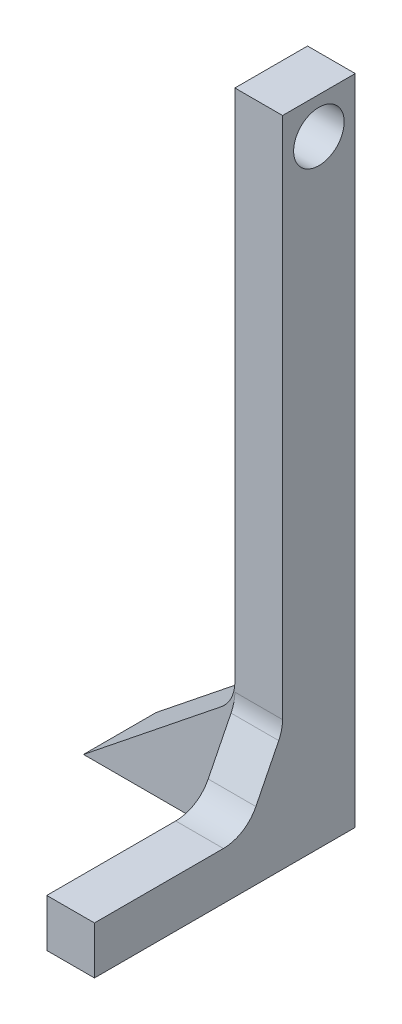
ISO-10303-21;
HEADER;
FILE_DESCRIPTION(('STEP AP214'),'2;1');
FILE_NAME('part.step','',(''),(''),'','','');
FILE_SCHEMA(('AUTOMOTIVE_DESIGN { 1 0 10303 214 1 1 1 1 }'));
ENDSEC;
DATA;
#1=APPLICATION_CONTEXT('core data for automotive mechanical design processes');
#2=APPLICATION_PROTOCOL_DEFINITION('international standard','automotive_design',2000,#1);
#3=PRODUCT_CONTEXT('',#1,'mechanical');
#4=PRODUCT('Part','Part','',(#3));
#5=PRODUCT_RELATED_PRODUCT_CATEGORY('part','',(#4));
#6=PRODUCT_DEFINITION_FORMATION('','',#4);
#7=PRODUCT_DEFINITION_CONTEXT('part definition',#1,'design');
#8=PRODUCT_DEFINITION('design','',#6,#7);
#9=PRODUCT_DEFINITION_SHAPE('','',#8);
#10=(LENGTH_UNIT() NAMED_UNIT(*) SI_UNIT(.MILLI.,.METRE.));
#11=(NAMED_UNIT(*) PLANE_ANGLE_UNIT() SI_UNIT($,.RADIAN.));
#12=(NAMED_UNIT(*) SI_UNIT($,.STERADIAN.) SOLID_ANGLE_UNIT());
#13=UNCERTAINTY_MEASURE_WITH_UNIT(LENGTH_MEASURE(1.E-05),#10,'distance_accuracy_value','');
#14=(GEOMETRIC_REPRESENTATION_CONTEXT(3) GLOBAL_UNCERTAINTY_ASSIGNED_CONTEXT((#13)) GLOBAL_UNIT_ASSIGNED_CONTEXT((#10,
#11,#12)) REPRESENTATION_CONTEXT('',''));
#15=CARTESIAN_POINT('',(0.,0.,0.));
#16=DIRECTION('',(0.,0.,1.));
#17=DIRECTION('',(1.,0.,0.));
#18=AXIS2_PLACEMENT_3D('',#15,#16,#17);
#19=CARTESIAN_POINT('',(37.7307458847143,0.,0.));
#20=DIRECTION('',(1.,0.,0.));
#21=DIRECTION('',(0.,0.,-1.));
#22=AXIS2_PLACEMENT_3D('',#19,#20,#21);
#23=PLANE('',#22);
#24=CARTESIAN_POINT('',(37.7307458847143,49.8361725350088,-136.328078847471));
#25=DIRECTION('',(1.,0.,0.));
#26=DIRECTION('',(0.,0.,-1.));
#27=AXIS2_PLACEMENT_3D('',#24,#25,#26);
#28=CIRCLE('',#27,5.3);
#29=CARTESIAN_POINT('',(37.7307458847143,49.8361725350088,-141.628078847471));
#30=VERTEX_POINT('',#29);
#31=EDGE_CURVE('E161',#30,#30,#28,.T.);
#32=ORIENTED_EDGE('',*,*,#31,.T.);
#33=EDGE_LOOP('',(#32));
#34=FACE_BOUND('',#33,.T.);
#35=DIRECTION('',(0.,1.,0.));
#36=VECTOR('',#35,1.);
#37=CARTESIAN_POINT('',(37.7307458847143,57.4561725350087,-143.948078847471));
#38=LINE('',#37,#36);
#39=CARTESIAN_POINT('',(37.7307458847143,-50.3964661271436,-143.948078847471));
#40=VERTEX_POINT('',#39);
#41=CARTESIAN_POINT('',(37.7307458847143,57.4561725350087,-143.948078847471));
#42=VERTEX_POINT('',#41);
#43=EDGE_CURVE('E179',#40,#42,#38,.T.);
#44=ORIENTED_EDGE('',*,*,#43,.F.);
#45=DIRECTION('',(0.,0.,-1.));
#46=VECTOR('',#45,1.);
#47=CARTESIAN_POINT('',(37.7307458847143,-50.3964661271441,-1.50983089837006E-13));
#48=LINE('',#47,#46);
#49=CARTESIAN_POINT('',(37.7307458847143,-50.3964661271437,-128.708078847471));
#50=VERTEX_POINT('',#49);
#51=EDGE_CURVE('E200',#40,#50,#48,.F.);
#52=ORIENTED_EDGE('',*,*,#51,.T.);
#53=DIRECTION('',(0.,-1.,0.));
#54=VECTOR('',#53,1.);
#55=CARTESIAN_POINT('',(37.7307458847143,57.4561725350087,-128.708078847471));
#56=LINE('',#55,#54);
#57=CARTESIAN_POINT('',(37.7307458847143,57.4561725350087,-128.708078847471));
#58=VERTEX_POINT('',#57);
#59=EDGE_CURVE('E164',#58,#50,#56,.T.);
#60=ORIENTED_EDGE('',*,*,#59,.F.);
#61=DIRECTION('',(0.,0.,1.));
#62=VECTOR('',#61,1.);
#63=CARTESIAN_POINT('',(37.7307458847143,57.4561725350087,-128.708078847471));
#64=LINE('',#63,#62);
#65=EDGE_CURVE('E170',#42,#58,#64,.T.);
#66=ORIENTED_EDGE('',*,*,#65,.F.);
#67=EDGE_LOOP('',(#44,#52,#60,#66));
#68=FACE_BOUND('',#67,.T.);
#69=ADVANCED_FACE('F33',(#34,#68),#23,.F.);
#70=CARTESIAN_POINT('',(47.7307458847143,57.4561725350087,-128.708078847471));
#71=DIRECTION('',(0.,0.,-1.));
#72=DIRECTION('',(0.,1.,0.));
#73=AXIS2_PLACEMENT_3D('',#70,#71,#72);
#74=PLANE('',#73);
#75=DIRECTION('',(0.,-1.,0.));
#76=VECTOR('',#75,1.);
#77=CARTESIAN_POINT('',(37.7307458847143,-54.0588274649912,-128.708078847471));
#78=LINE('',#77,#76);
#79=CARTESIAN_POINT('',(37.7307458847143,-52.2599894764427,-128.708078847471));
#80=VERTEX_POINT('',#79);
#81=CARTESIAN_POINT('',(37.7307458847143,-79.458827464991,-128.708078847471));
#82=VERTEX_POINT('',#81);
#83=EDGE_CURVE('E152',#80,#82,#78,.T.);
#84=ORIENTED_EDGE('',*,*,#83,.F.);
#85=DIRECTION('',(1.,0.,0.));
#86=VECTOR('',#85,1.);
#87=CARTESIAN_POINT('',(47.7307458847136,-52.2599894764427,-128.708078847471));
#88=LINE('',#87,#86);
#89=CARTESIAN_POINT('',(47.7307458847143,-52.2599894764427,-128.708078847471));
#90=VERTEX_POINT('',#89);
#91=EDGE_CURVE('E210',#80,#90,#88,.T.);
#92=ORIENTED_EDGE('',*,*,#91,.T.);
#93=DIRECTION('',(0.,-1.,0.));
#94=VECTOR('',#93,1.);
#95=CARTESIAN_POINT('',(47.7307458847143,57.4561725350087,-128.708078847471));
#96=LINE('',#95,#94);
#97=CARTESIAN_POINT('',(47.7307458847143,57.4561725350087,-128.708078847471));
#98=VERTEX_POINT('',#97);
#99=EDGE_CURVE('E167',#98,#90,#96,.T.);
#100=ORIENTED_EDGE('',*,*,#99,.F.);
#101=DIRECTION('',(-1.,0.,0.));
#102=VECTOR('',#101,1.);
#103=CARTESIAN_POINT('',(47.7307458847143,57.4561725350087,-128.708078847471));
#104=LINE('',#103,#102);
#105=EDGE_CURVE('E176',#98,#58,#104,.T.);
#106=ORIENTED_EDGE('',*,*,#105,.T.);
#107=ORIENTED_EDGE('',*,*,#59,.T.);
#108=CARTESIAN_POINT('',(30.1107458847143,-50.3964661271437,-128.708078847471));
#109=DIRECTION('',(0.,0.,-1.));
#110=DIRECTION('',(0.,1.,0.));
#111=AXIS2_PLACEMENT_3D('',#108,#109,#110);
#112=CIRCLE('',#111,7.62);
#113=CARTESIAN_POINT('',(34.870922147079,-56.3466864550996,-128.708078847471));
#114=VERTEX_POINT('',#113);
#115=EDGE_CURVE('E207',#50,#114,#112,.T.);
#116=ORIENTED_EDGE('',*,*,#115,.T.);
#117=DIRECTION('',(-0.780868809443035,-0.624695047554419,0.));
#118=VECTOR('',#117,1.);
#119=CARTESIAN_POINT('',(5.98074588471443,-79.4588274649909,-128.708078847471));
#120=LINE('',#119,#118);
#121=CARTESIAN_POINT('',(5.98074588471434,-79.458827464991,-128.708078847471));
#122=VERTEX_POINT('',#121);
#123=EDGE_CURVE('E153',#114,#122,#120,.T.);
#124=ORIENTED_EDGE('',*,*,#123,.T.);
#125=DIRECTION('',(-1.,0.,0.));
#126=VECTOR('',#125,1.);
#127=CARTESIAN_POINT('',(47.7307458847143,-79.458827464991,-128.708078847471));
#128=LINE('',#127,#126);
#129=EDGE_CURVE('E189',#82,#122,#128,.T.);
#130=ORIENTED_EDGE('',*,*,#129,.F.);
#131=EDGE_LOOP('',(#84,#92,#100,#106,#107,#116,#124,#130));
#132=FACE_BOUND('',#131,.T.);
#133=ADVANCED_FACE('F216',(#132),#74,.F.);
#134=CARTESIAN_POINT('',(47.7307458847143,-79.458827464991,-128.708078847471));
#135=DIRECTION('',(0.,1.,0.));
#136=DIRECTION('',(0.,0.,1.));
#137=AXIS2_PLACEMENT_3D('',#134,#135,#136);
#138=PLANE('',#137);
#139=DIRECTION('',(0.,0.,-1.));
#140=VECTOR('',#139,1.);
#141=CARTESIAN_POINT('',(47.7307458847143,-79.458827464991,-128.708078847471));
#142=LINE('',#141,#140);
#143=CARTESIAN_POINT('',(47.730745884714,-79.458827464991,-89.2580788474712));
#144=VERTEX_POINT('',#143);
#145=CARTESIAN_POINT('',(47.7307458847143,-79.458827464991,-143.948078847471));
#146=VERTEX_POINT('',#145);
#147=EDGE_CURVE('E169',#144,#146,#142,.T.);
#148=ORIENTED_EDGE('',*,*,#147,.F.);
#149=DIRECTION('',(1.,0.,0.));
#150=VECTOR('',#149,1.);
#151=CARTESIAN_POINT('',(-9.18899942576219,-79.458827464991,-89.258078847471));
#152=LINE('',#151,#150);
#153=CARTESIAN_POINT('',(37.7307458847143,-79.458827464991,-89.2580788474711));
#154=VERTEX_POINT('',#153);
#155=EDGE_CURVE('E140',#154,#144,#152,.T.);
#156=ORIENTED_EDGE('',*,*,#155,.F.);
#157=DIRECTION('',(0.,0.,1.));
#158=VECTOR('',#157,1.);
#159=CARTESIAN_POINT('',(37.7307458847143,-79.458827464991,-128.708078847471));
#160=LINE('',#159,#158);
#161=EDGE_CURVE('E242',#82,#154,#160,.T.);
#162=ORIENTED_EDGE('',*,*,#161,.F.);
#163=ORIENTED_EDGE('',*,*,#129,.T.);
#164=DIRECTION('',(0.,0.,-1.));
#165=VECTOR('',#164,1.);
#166=CARTESIAN_POINT('',(5.98074588471449,-79.458827464991,-88.0482399397721));
#167=LINE('',#166,#165);
#168=CARTESIAN_POINT('',(5.98074588471429,-79.458827464991,-143.948078847471));
#169=VERTEX_POINT('',#168);
#170=EDGE_CURVE('E156',#122,#169,#167,.T.);
#171=ORIENTED_EDGE('',*,*,#170,.T.);
#172=DIRECTION('',(-1.,0.,0.));
#173=VECTOR('',#172,1.);
#174=CARTESIAN_POINT('',(47.7307458847143,-79.458827464991,-143.948078847471));
#175=LINE('',#174,#173);
#176=EDGE_CURVE('E187',#146,#169,#175,.T.);
#177=ORIENTED_EDGE('',*,*,#176,.F.);
#178=EDGE_LOOP('',(#148,#156,#162,#163,#171,#177));
#179=FACE_BOUND('',#178,.T.);
#180=ADVANCED_FACE('F239',(#179),#138,.F.);
#181=CARTESIAN_POINT('',(47.7307458847143,57.4561725350087,-143.948078847471));
#182=DIRECTION('',(0.,0.,1.));
#183=DIRECTION('',(0.,-1.,0.));
#184=AXIS2_PLACEMENT_3D('',#181,#182,#183);
#185=PLANE('',#184);
#186=ORIENTED_EDGE('',*,*,#176,.T.);
#187=DIRECTION('',(0.780868809443035,0.624695047554419,0.));
#188=VECTOR('',#187,1.);
#189=CARTESIAN_POINT('',(5.98074588471429,-79.458827464991,-143.948078847471));
#190=LINE('',#189,#188);
#191=CARTESIAN_POINT('',(34.870922147079,-56.3466864550996,-143.948078847471));
#192=VERTEX_POINT('',#191);
#193=EDGE_CURVE('E151',#169,#192,#190,.T.);
#194=ORIENTED_EDGE('',*,*,#193,.T.);
#195=CARTESIAN_POINT('',(30.1107458847143,-50.3964661271437,-143.948078847471));
#196=DIRECTION('',(0.,0.,1.));
#197=DIRECTION('',(0.,-1.,0.));
#198=AXIS2_PLACEMENT_3D('',#195,#196,#197);
#199=CIRCLE('',#198,7.62);
#200=EDGE_CURVE('E205',#192,#40,#199,.T.);
#201=ORIENTED_EDGE('',*,*,#200,.T.);
#202=ORIENTED_EDGE('',*,*,#43,.T.);
#203=DIRECTION('',(-1.,0.,0.));
#204=VECTOR('',#203,1.);
#205=CARTESIAN_POINT('',(47.7307458847143,57.4561725350087,-143.948078847471));
#206=LINE('',#205,#204);
#207=CARTESIAN_POINT('',(47.7307458847143,57.4561725350087,-143.948078847471));
#208=VERTEX_POINT('',#207);
#209=EDGE_CURVE('E184',#208,#42,#206,.T.);
#210=ORIENTED_EDGE('',*,*,#209,.F.);
#211=DIRECTION('',(0.,1.,0.));
#212=VECTOR('',#211,1.);
#213=CARTESIAN_POINT('',(47.7307458847143,57.4561725350087,-143.948078847471));
#214=LINE('',#213,#212);
#215=EDGE_CURVE('E172',#146,#208,#214,.T.);
#216=ORIENTED_EDGE('',*,*,#215,.F.);
#217=EDGE_LOOP('',(#186,#194,#201,#202,#210,#216));
#218=FACE_BOUND('',#217,.T.);
#219=ADVANCED_FACE('F245',(#218),#185,.F.);
#220=CARTESIAN_POINT('',(47.7307458847143,57.4561725350087,-128.708078847471));
#221=DIRECTION('',(0.,-1.,0.));
#222=DIRECTION('',(0.,0.,-1.));
#223=AXIS2_PLACEMENT_3D('',#220,#221,#222);
#224=PLANE('',#223);
#225=ORIENTED_EDGE('',*,*,#65,.T.);
#226=ORIENTED_EDGE('',*,*,#105,.F.);
#227=DIRECTION('',(0.,0.,1.));
#228=VECTOR('',#227,1.);
#229=CARTESIAN_POINT('',(47.7307458847143,57.4561725350087,-128.708078847471));
#230=LINE('',#229,#228);
#231=EDGE_CURVE('E174',#208,#98,#230,.T.);
#232=ORIENTED_EDGE('',*,*,#231,.F.);
#233=ORIENTED_EDGE('',*,*,#209,.T.);
#234=EDGE_LOOP('',(#225,#226,#232,#233));
#235=FACE_BOUND('',#234,.T.);
#236=ADVANCED_FACE('F225',(#235),#224,.F.);
#237=CARTESIAN_POINT('',(47.7307458847143,0.,0.));
#238=DIRECTION('',(1.,0.,0.));
#239=DIRECTION('',(0.,0.,-1.));
#240=AXIS2_PLACEMENT_3D('',#237,#238,#239);
#241=PLANE('',#240);
#242=CARTESIAN_POINT('',(47.7307458847139,49.8361725350088,-136.328078847471));
#243=DIRECTION('',(1.,0.,0.));
#244=DIRECTION('',(0.,0.,-1.));
#245=AXIS2_PLACEMENT_3D('',#242,#243,#244);
#246=CIRCLE('',#245,5.3);
#247=CARTESIAN_POINT('',(47.7307458847138,49.8361725350088,-141.628078847471));
#248=VERTEX_POINT('',#247);
#249=EDGE_CURVE('E155',#248,#248,#246,.T.);
#250=ORIENTED_EDGE('',*,*,#249,.F.);
#251=EDGE_LOOP('',(#250));
#252=FACE_BOUND('',#251,.T.);
#253=ORIENTED_EDGE('',*,*,#99,.T.);
#254=CARTESIAN_POINT('',(47.7307458847143,-52.2599894764427,-121.088078847471));
#255=DIRECTION('',(1.,0.,0.));
#256=DIRECTION('',(0.,0.,-1.));
#257=AXIS2_PLACEMENT_3D('',#254,#255,#256);
#258=CIRCLE('',#257,7.62);
#259=CARTESIAN_POINT('',(47.7307458847139,-55.6677570741524,-127.90361404289));
#260=VERTEX_POINT('',#259);
#261=EDGE_CURVE('E41',#90,#260,#258,.F.);
#262=ORIENTED_EDGE('',*,*,#261,.T.);
#263=DIRECTION('',(0.,-0.894427190999914,0.447213595499962));
#264=VECTOR('',#263,1.);
#265=CARTESIAN_POINT('',(47.7307458847139,-69.4588274649909,-121.008078847471));
#266=LINE('',#265,#264);
#267=CARTESIAN_POINT('',(47.7307458847139,-65.2465950627006,-123.114195048616));
#268=VERTEX_POINT('',#267);
#269=EDGE_CURVE('E130',#260,#268,#266,.T.);
#270=ORIENTED_EDGE('',*,*,#269,.T.);
#271=CARTESIAN_POINT('',(47.7307458847143,-61.8388274649909,-116.298659853197));
#272=DIRECTION('',(1.,0.,0.));
#273=DIRECTION('',(0.,0.,-1.));
#274=AXIS2_PLACEMENT_3D('',#271,#272,#273);
#275=CIRCLE('',#274,7.62);
#276=CARTESIAN_POINT('',(47.7307458847139,-69.4588274649909,-116.298659853197));
#277=VERTEX_POINT('',#276);
#278=EDGE_CURVE('E127',#268,#277,#275,.F.);
#279=ORIENTED_EDGE('',*,*,#278,.T.);
#280=DIRECTION('',(0.,0.,1.));
#281=VECTOR('',#280,1.);
#282=CARTESIAN_POINT('',(47.730745884714,-69.458827464991,-89.2580788474712));
#283=LINE('',#282,#281);
#284=CARTESIAN_POINT('',(47.730745884714,-69.458827464991,-89.2580788474712));
#285=VERTEX_POINT('',#284);
#286=EDGE_CURVE('E121',#277,#285,#283,.T.);
#287=ORIENTED_EDGE('',*,*,#286,.T.);
#288=DIRECTION('',(0.,-1.,0.));
#289=VECTOR('',#288,1.);
#290=CARTESIAN_POINT('',(47.730745884714,-79.458827464991,-89.2580788474712));
#291=LINE('',#290,#289);
#292=EDGE_CURVE('E125',#285,#144,#291,.T.);
#293=ORIENTED_EDGE('',*,*,#292,.T.);
#294=ORIENTED_EDGE('',*,*,#147,.T.);
#295=ORIENTED_EDGE('',*,*,#215,.T.);
#296=ORIENTED_EDGE('',*,*,#231,.T.);
#297=EDGE_LOOP('',(#253,#262,#270,#279,#287,#293,#294,#295,#296));
#298=FACE_BOUND('',#297,.T.);
#299=ADVANCED_FACE('F123',(#252,#298),#241,.T.);
#300=CARTESIAN_POINT('',(37.7307458847143,49.8361725350088,-136.328078847471));
#301=DIRECTION('',(1.,0.,0.));
#302=DIRECTION('',(0.,0.,-1.));
#303=AXIS2_PLACEMENT_3D('',#300,#301,#302);
#304=CYLINDRICAL_SURFACE('',#303,5.3);
#305=ORIENTED_EDGE('',*,*,#31,.F.);
#306=EDGE_LOOP('',(#305));
#307=FACE_BOUND('',#306,.T.);
#308=ORIENTED_EDGE('',*,*,#249,.T.);
#309=EDGE_LOOP('',(#308));
#310=FACE_BOUND('',#309,.T.);
#311=ADVANCED_FACE('F264',(#307,#310),#304,.F.);
#312=CARTESIAN_POINT('',(5.98074588471449,-79.458827464991,-88.0482399397721));
#313=DIRECTION('',(-0.624695047554419,0.780868809443035,0.));
#314=DIRECTION('',(-0.780868809443035,-0.624695047554419,0.));
#315=AXIS2_PLACEMENT_3D('',#312,#313,#314);
#316=PLANE('',#315);
#317=ORIENTED_EDGE('',*,*,#123,.F.);
#318=DIRECTION('',(0.,0.,-1.));
#319=VECTOR('',#318,1.);
#320=CARTESIAN_POINT('',(34.870922147079,-56.3466864550997,-88.048239939772));
#321=LINE('',#320,#319);
#322=EDGE_CURVE('E197',#114,#192,#321,.T.);
#323=ORIENTED_EDGE('',*,*,#322,.T.);
#324=ORIENTED_EDGE('',*,*,#193,.F.);
#325=ORIENTED_EDGE('',*,*,#170,.F.);
#326=EDGE_LOOP('',(#317,#323,#324,#325));
#327=FACE_BOUND('',#326,.T.);
#328=ADVANCED_FACE('F243',(#327),#316,.T.);
#329=CARTESIAN_POINT('',(-9.18899942576219,-79.458827464991,-89.258078847471));
#330=DIRECTION('',(0.,0.,1.));
#331=DIRECTION('',(1.,0.,0.));
#332=AXIS2_PLACEMENT_3D('',#329,#330,#331);
#333=PLANE('',#332);
#334=DIRECTION('',(0.,1.,0.));
#335=VECTOR('',#334,1.);
#336=CARTESIAN_POINT('',(37.7307458847143,-79.458827464991,-89.2580788474711));
#337=LINE('',#336,#335);
#338=CARTESIAN_POINT('',(37.7307458847143,-69.458827464991,-89.258078847471));
#339=VERTEX_POINT('',#338);
#340=EDGE_CURVE('E288',#154,#339,#337,.T.);
#341=ORIENTED_EDGE('',*,*,#340,.F.);
#342=ORIENTED_EDGE('',*,*,#155,.T.);
#343=ORIENTED_EDGE('',*,*,#292,.F.);
#344=DIRECTION('',(1.,0.,0.));
#345=VECTOR('',#344,1.);
#346=CARTESIAN_POINT('',(-9.18899942576219,-69.458827464991,-89.258078847471));
#347=LINE('',#346,#345);
#348=EDGE_CURVE('E134',#339,#285,#347,.T.);
#349=ORIENTED_EDGE('',*,*,#348,.F.);
#350=EDGE_LOOP('',(#341,#342,#343,#349));
#351=FACE_BOUND('',#350,.T.);
#352=ADVANCED_FACE('F143',(#351),#333,.T.);
#353=CARTESIAN_POINT('',(-9.18899942576219,-69.458827464991,-89.258078847471));
#354=DIRECTION('',(0.,1.,0.));
#355=DIRECTION('',(0.,0.,1.));
#356=AXIS2_PLACEMENT_3D('',#353,#354,#355);
#357=PLANE('',#356);
#358=ORIENTED_EDGE('',*,*,#286,.F.);
#359=DIRECTION('',(1.,0.,0.));
#360=VECTOR('',#359,1.);
#361=CARTESIAN_POINT('',(37.7307458847143,-69.4588274649909,-116.298659853197));
#362=LINE('',#361,#360);
#363=CARTESIAN_POINT('',(37.7307458847143,-69.4588274649909,-116.298659853197));
#364=VERTEX_POINT('',#363);
#365=EDGE_CURVE('E195',#277,#364,#362,.F.);
#366=ORIENTED_EDGE('',*,*,#365,.T.);
#367=DIRECTION('',(0.,0.,-1.));
#368=VECTOR('',#367,1.);
#369=CARTESIAN_POINT('',(37.7307458847143,-69.458827464991,-89.258078847471));
#370=LINE('',#369,#368);
#371=EDGE_CURVE('E137',#339,#364,#370,.T.);
#372=ORIENTED_EDGE('',*,*,#371,.F.);
#373=ORIENTED_EDGE('',*,*,#348,.T.);
#374=EDGE_LOOP('',(#358,#366,#372,#373));
#375=FACE_BOUND('',#374,.T.);
#376=ADVANCED_FACE('F135',(#375),#357,.T.);
#377=CARTESIAN_POINT('',(-9.18899942576229,-69.4588274649909,-121.008078847471));
#378=DIRECTION('',(0.,0.447213595499962,0.894427190999914));
#379=DIRECTION('',(0.,-0.894427190999914,0.447213595499962));
#380=AXIS2_PLACEMENT_3D('',#377,#378,#379);
#381=PLANE('',#380);
#382=ORIENTED_EDGE('',*,*,#269,.F.);
#383=DIRECTION('',(1.,0.,0.));
#384=VECTOR('',#383,1.);
#385=CARTESIAN_POINT('',(-9.1889994257622,-55.6677570741521,-127.90361404289));
#386=LINE('',#385,#384);
#387=CARTESIAN_POINT('',(37.7307458847143,-55.6677570741524,-127.90361404289));
#388=VERTEX_POINT('',#387);
#389=EDGE_CURVE('E54',#260,#388,#386,.F.);
#390=ORIENTED_EDGE('',*,*,#389,.T.);
#391=DIRECTION('',(0.,0.894427190999914,-0.447213595499962));
#392=VECTOR('',#391,1.);
#393=CARTESIAN_POINT('',(37.7307458847143,-69.458827464991,-121.008078847471));
#394=LINE('',#393,#392);
#395=CARTESIAN_POINT('',(37.7307458847143,-65.2465950627006,-123.114195048616));
#396=VERTEX_POINT('',#395);
#397=EDGE_CURVE('E149',#396,#388,#394,.T.);
#398=ORIENTED_EDGE('',*,*,#397,.F.);
#399=DIRECTION('',(1.,0.,0.));
#400=VECTOR('',#399,1.);
#401=CARTESIAN_POINT('',(47.7307458847139,-65.2465950627006,-123.114195048616));
#402=LINE('',#401,#400);
#403=EDGE_CURVE('E192',#396,#268,#402,.T.);
#404=ORIENTED_EDGE('',*,*,#403,.T.);
#405=EDGE_LOOP('',(#382,#390,#398,#404));
#406=FACE_BOUND('',#405,.T.);
#407=ADVANCED_FACE('F271',(#406),#381,.T.);
#408=CARTESIAN_POINT('',(37.7307458847143,0.,0.));
#409=DIRECTION('',(1.,0.,0.));
#410=DIRECTION('',(0.,0.,-1.));
#411=AXIS2_PLACEMENT_3D('',#408,#409,#410);
#412=PLANE('',#411);
#413=ORIENTED_EDGE('',*,*,#83,.T.);
#414=ORIENTED_EDGE('',*,*,#161,.T.);
#415=ORIENTED_EDGE('',*,*,#340,.T.);
#416=ORIENTED_EDGE('',*,*,#371,.T.);
#417=CARTESIAN_POINT('',(37.7307458847143,-61.8388274649909,-116.298659853197));
#418=DIRECTION('',(1.,0.,0.));
#419=DIRECTION('',(0.,0.,-1.));
#420=AXIS2_PLACEMENT_3D('',#417,#418,#419);
#421=CIRCLE('',#420,7.62);
#422=EDGE_CURVE('E203',#364,#396,#421,.T.);
#423=ORIENTED_EDGE('',*,*,#422,.T.);
#424=ORIENTED_EDGE('',*,*,#397,.T.);
#425=CARTESIAN_POINT('',(37.7307458847143,-52.2599894764427,-121.088078847471));
#426=DIRECTION('',(1.,0.,0.));
#427=DIRECTION('',(0.,0.,-1.));
#428=AXIS2_PLACEMENT_3D('',#425,#426,#427);
#429=CIRCLE('',#428,7.62);
#430=EDGE_CURVE('E11',#388,#80,#429,.T.);
#431=ORIENTED_EDGE('',*,*,#430,.T.);
#432=EDGE_LOOP('',(#413,#414,#415,#416,#423,#424,#431));
#433=FACE_BOUND('',#432,.T.);
#434=ADVANCED_FACE('F274',(#433),#412,.F.);
#435=CARTESIAN_POINT('',(-9.18899942576227,-61.8388274649909,-116.298659853197));
#436=DIRECTION('',(-1.,0.,0.));
#437=DIRECTION('',(0.,0.,1.));
#438=AXIS2_PLACEMENT_3D('',#435,#436,#437);
#439=CYLINDRICAL_SURFACE('',#438,7.62);
#440=ORIENTED_EDGE('',*,*,#422,.F.);
#441=ORIENTED_EDGE('',*,*,#365,.F.);
#442=ORIENTED_EDGE('',*,*,#278,.F.);
#443=ORIENTED_EDGE('',*,*,#403,.F.);
#444=EDGE_LOOP('',(#440,#441,#442,#443));
#445=FACE_BOUND('',#444,.T.);
#446=ADVANCED_FACE('F280',(#445),#439,.F.);
#447=CARTESIAN_POINT('',(30.1107458847143,-50.3964661271438,-88.048239939772));
#448=DIRECTION('',(0.,0.,-1.));
#449=DIRECTION('',(0.,1.,0.));
#450=AXIS2_PLACEMENT_3D('',#447,#448,#449);
#451=CYLINDRICAL_SURFACE('',#450,7.62);
#452=ORIENTED_EDGE('',*,*,#115,.F.);
#453=ORIENTED_EDGE('',*,*,#51,.F.);
#454=ORIENTED_EDGE('',*,*,#200,.F.);
#455=ORIENTED_EDGE('',*,*,#322,.F.);
#456=EDGE_LOOP('',(#452,#453,#454,#455));
#457=FACE_BOUND('',#456,.T.);
#458=ADVANCED_FACE('F233',(#457),#451,.F.);
#459=CARTESIAN_POINT('',(47.7307458847136,-52.2599894764427,-121.088078847471));
#460=DIRECTION('',(1.,0.,0.));
#461=DIRECTION('',(0.,1.,0.));
#462=AXIS2_PLACEMENT_3D('',#459,#460,#461);
#463=CYLINDRICAL_SURFACE('',#462,7.62);
#464=ORIENTED_EDGE('',*,*,#430,.F.);
#465=ORIENTED_EDGE('',*,*,#389,.F.);
#466=ORIENTED_EDGE('',*,*,#261,.F.);
#467=ORIENTED_EDGE('',*,*,#91,.F.);
#468=EDGE_LOOP('',(#464,#465,#466,#467));
#469=FACE_BOUND('',#468,.T.);
#470=ADVANCED_FACE('F35',(#469),#463,.F.);
#471=CLOSED_SHELL('',(#69,#133,#180,#219,#236,#299,#311,#328,#352,#376,#407,#434,#446,#458,#470));
#472=MANIFOLD_SOLID_BREP('B2',#471);
#473=ADVANCED_BREP_SHAPE_REPRESENTATION('',(#18,#472),#14);
#474=SHAPE_DEFINITION_REPRESENTATION(#9,#473);
ENDSEC;
END-ISO-10303-21;
